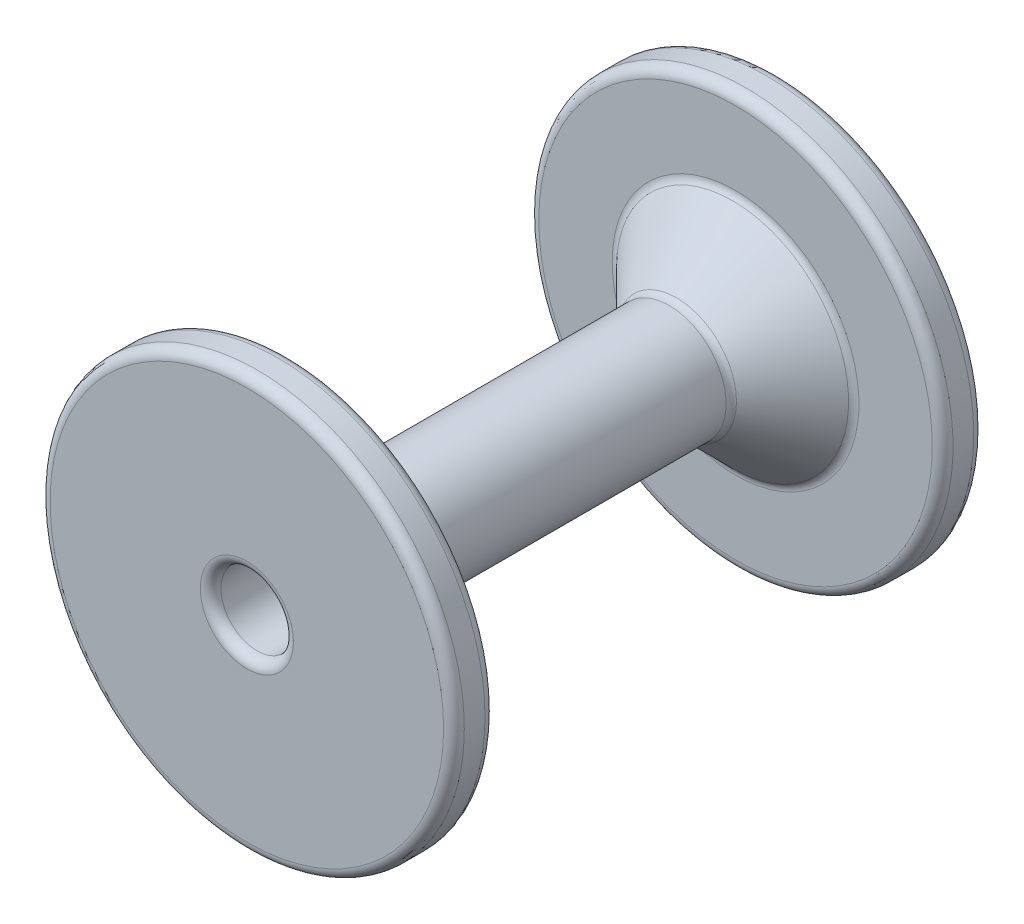
ISO-10303-21;
HEADER;
FILE_DESCRIPTION(('STEP AP214'),'2;1');
FILE_NAME('part.step','',(''),(''),'','','');
FILE_SCHEMA(('AUTOMOTIVE_DESIGN { 1 0 10303 214 1 1 1 1 }'));
ENDSEC;
DATA;
#1=APPLICATION_CONTEXT('core data for automotive mechanical design processes');
#2=APPLICATION_PROTOCOL_DEFINITION('international standard','automotive_design',2000,#1);
#3=PRODUCT_CONTEXT('',#1,'mechanical');
#4=PRODUCT('Part','Part','',(#3));
#5=PRODUCT_RELATED_PRODUCT_CATEGORY('part','',(#4));
#6=PRODUCT_DEFINITION_FORMATION('','',#4);
#7=PRODUCT_DEFINITION_CONTEXT('part definition',#1,'design');
#8=PRODUCT_DEFINITION('design','',#6,#7);
#9=PRODUCT_DEFINITION_SHAPE('','',#8);
#10=(LENGTH_UNIT() NAMED_UNIT(*) SI_UNIT(.MILLI.,.METRE.));
#11=(NAMED_UNIT(*) PLANE_ANGLE_UNIT() SI_UNIT($,.RADIAN.));
#12=(NAMED_UNIT(*) SI_UNIT($,.STERADIAN.) SOLID_ANGLE_UNIT());
#13=UNCERTAINTY_MEASURE_WITH_UNIT(LENGTH_MEASURE(1.E-05),#10,'distance_accuracy_value','');
#14=(GEOMETRIC_REPRESENTATION_CONTEXT(3) GLOBAL_UNCERTAINTY_ASSIGNED_CONTEXT((#13)) GLOBAL_UNIT_ASSIGNED_CONTEXT((#10,
#11,#12)) REPRESENTATION_CONTEXT('',''));
#15=CARTESIAN_POINT('',(0.,0.,0.));
#16=DIRECTION('',(0.,0.,1.));
#17=DIRECTION('',(1.,0.,0.));
#18=AXIS2_PLACEMENT_3D('',#15,#16,#17);
#19=CARTESIAN_POINT('',(0.,0.,12.8));
#20=DIRECTION('',(0.,0.,-1.));
#21=DIRECTION('',(-1.,0.,0.));
#22=AXIS2_PLACEMENT_3D('',#19,#20,#21);
#23=CYLINDRICAL_SURFACE('',#22,1.75);
#24=CARTESIAN_POINT('',(0.,0.,12.3));
#25=DIRECTION('',(0.,0.,1.));
#26=DIRECTION('',(1.,0.,0.));
#27=AXIS2_PLACEMENT_3D('',#24,#25,#26);
#28=CIRCLE('',#27,1.75);
#29=CARTESIAN_POINT('',(1.75,0.,12.3));
#30=VERTEX_POINT('',#29);
#31=EDGE_CURVE('E11',#30,#30,#28,.T.);
#32=ORIENTED_EDGE('',*,*,#31,.T.);
#33=EDGE_LOOP('',(#32));
#34=FACE_BOUND('',#33,.T.);
#35=CARTESIAN_POINT('',(0.,0.,-10.4));
#36=DIRECTION('',(0.,0.,-1.));
#37=DIRECTION('',(-1.,0.,0.));
#38=AXIS2_PLACEMENT_3D('',#35,#36,#37);
#39=CIRCLE('',#38,1.75);
#40=CARTESIAN_POINT('',(-1.75,0.,-10.4));
#41=VERTEX_POINT('',#40);
#42=EDGE_CURVE('E144',#41,#41,#39,.T.);
#43=ORIENTED_EDGE('',*,*,#42,.T.);
#44=EDGE_LOOP('',(#43));
#45=FACE_BOUND('',#44,.T.);
#46=ADVANCED_FACE('F36',(#34,#45),#23,.F.);
#47=CARTESIAN_POINT('',(0.,0.,12.8));
#48=DIRECTION('',(0.,0.,-1.));
#49=DIRECTION('',(-1.,0.,0.));
#50=AXIS2_PLACEMENT_3D('',#47,#48,#49);
#51=CYLINDRICAL_SURFACE('',#50,2.75);
#52=CARTESIAN_POINT('',(0.,0.,10.3));
#53=DIRECTION('',(0.,0.,1.));
#54=DIRECTION('',(1.,0.,0.));
#55=AXIS2_PLACEMENT_3D('',#52,#53,#54);
#56=CIRCLE('',#55,2.75);
#57=CARTESIAN_POINT('',(2.75,0.,10.3));
#58=VERTEX_POINT('',#57);
#59=EDGE_CURVE('E189',#58,#58,#56,.F.);
#60=ORIENTED_EDGE('',*,*,#59,.T.);
#61=EDGE_LOOP('',(#60));
#62=FACE_BOUND('',#61,.T.);
#63=CARTESIAN_POINT('',(0.,0.,-7.59289321881346));
#64=DIRECTION('',(0.,0.,1.));
#65=DIRECTION('',(1.,0.,0.));
#66=AXIS2_PLACEMENT_3D('',#63,#64,#65);
#67=CIRCLE('',#66,2.75);
#68=CARTESIAN_POINT('',(2.75,0.,-7.59289321881346));
#69=VERTEX_POINT('',#68);
#70=EDGE_CURVE('E186',#69,#69,#67,.T.);
#71=ORIENTED_EDGE('',*,*,#70,.T.);
#72=EDGE_LOOP('',(#71));
#73=FACE_BOUND('',#72,.T.);
#74=ADVANCED_FACE('F274',(#62,#73),#51,.T.);
#75=CARTESIAN_POINT('',(0.,0.,12.8));
#76=DIRECTION('',(0.,0.,1.));
#77=DIRECTION('',(1.,0.,0.));
#78=AXIS2_PLACEMENT_3D('',#75,#76,#77);
#79=PLANE('',#78);
#80=CARTESIAN_POINT('',(0.,0.,12.8));
#81=DIRECTION('',(0.,0.,1.));
#82=DIRECTION('',(1.,0.,0.));
#83=AXIS2_PLACEMENT_3D('',#80,#81,#82);
#84=CIRCLE('',#83,9.5);
#85=CARTESIAN_POINT('',(9.5,0.,12.8));
#86=VERTEX_POINT('',#85);
#87=EDGE_CURVE('E45',#86,#86,#84,.T.);
#88=ORIENTED_EDGE('',*,*,#87,.T.);
#89=EDGE_LOOP('',(#88));
#90=FACE_BOUND('',#89,.T.);
#91=CARTESIAN_POINT('',(0.,0.,12.8));
#92=DIRECTION('',(0.,0.,1.));
#93=DIRECTION('',(1.,0.,0.));
#94=AXIS2_PLACEMENT_3D('',#91,#92,#93);
#95=CIRCLE('',#94,2.25);
#96=CARTESIAN_POINT('',(2.25,0.,12.8));
#97=VERTEX_POINT('',#96);
#98=EDGE_CURVE('E219',#97,#97,#95,.F.);
#99=ORIENTED_EDGE('',*,*,#98,.T.);
#100=EDGE_LOOP('',(#99));
#101=FACE_BOUND('',#100,.T.);
#102=ADVANCED_FACE('F280',(#90,#101),#79,.T.);
#103=CARTESIAN_POINT('',(0.,0.,-12.8));
#104=DIRECTION('',(0.,0.,1.));
#105=DIRECTION('',(1.,0.,0.));
#106=AXIS2_PLACEMENT_3D('',#103,#104,#105);
#107=PLANE('',#106);
#108=CARTESIAN_POINT('',(0.,0.,-12.8));
#109=DIRECTION('',(0.,0.,1.));
#110=DIRECTION('',(1.,0.,0.));
#111=AXIS2_PLACEMENT_3D('',#108,#109,#110);
#112=CIRCLE('',#111,9.5);
#113=CARTESIAN_POINT('',(9.5,0.,-12.8));
#114=VERTEX_POINT('',#113);
#115=EDGE_CURVE('E205',#114,#114,#112,.F.);
#116=ORIENTED_EDGE('',*,*,#115,.T.);
#117=EDGE_LOOP('',(#116));
#118=FACE_BOUND('',#117,.T.);
#119=DIRECTION('',(-0.5,-0.866025403784439,0.));
#120=VECTOR('',#119,1.);
#121=CARTESIAN_POINT('',(2.81458256229942,-1.625,-12.8));
#122=LINE('',#121,#120);
#123=CARTESIAN_POINT('',(1.87638837486628,-3.25,-12.8));
#124=VERTEX_POINT('',#123);
#125=CARTESIAN_POINT('',(3.75277674973257,0.,-12.8));
#126=VERTEX_POINT('',#125);
#127=EDGE_CURVE('E200',#124,#126,#122,.F.);
#128=ORIENTED_EDGE('',*,*,#127,.T.);
#129=DIRECTION('',(0.5,-0.866025403784439,0.));
#130=VECTOR('',#129,1.);
#131=CARTESIAN_POINT('',(2.81458256229943,1.625,-12.8));
#132=LINE('',#131,#130);
#133=CARTESIAN_POINT('',(1.87638837486628,3.25,-12.8));
#134=VERTEX_POINT('',#133);
#135=EDGE_CURVE('E202',#126,#134,#132,.F.);
#136=ORIENTED_EDGE('',*,*,#135,.T.);
#137=DIRECTION('',(1.,0.,0.));
#138=VECTOR('',#137,1.);
#139=CARTESIAN_POINT('',(0.,3.25,-12.8));
#140=LINE('',#139,#138);
#141=CARTESIAN_POINT('',(-1.87638837486628,3.25,-12.8));
#142=VERTEX_POINT('',#141);
#143=EDGE_CURVE('E192',#134,#142,#140,.F.);
#144=ORIENTED_EDGE('',*,*,#143,.T.);
#145=DIRECTION('',(0.5,0.866025403784439,0.));
#146=VECTOR('',#145,1.);
#147=CARTESIAN_POINT('',(-2.81458256229943,1.625,-12.8));
#148=LINE('',#147,#146);
#149=CARTESIAN_POINT('',(-3.75277674973257,0.,-12.8));
#150=VERTEX_POINT('',#149);
#151=EDGE_CURVE('E194',#142,#150,#148,.F.);
#152=ORIENTED_EDGE('',*,*,#151,.T.);
#153=DIRECTION('',(-0.5,0.866025403784439,0.));
#154=VECTOR('',#153,1.);
#155=CARTESIAN_POINT('',(-2.81458256229942,-1.625,-12.8));
#156=LINE('',#155,#154);
#157=CARTESIAN_POINT('',(-1.87638837486628,-3.25,-12.8));
#158=VERTEX_POINT('',#157);
#159=EDGE_CURVE('E196',#150,#158,#156,.F.);
#160=ORIENTED_EDGE('',*,*,#159,.T.);
#161=DIRECTION('',(-1.,0.,0.));
#162=VECTOR('',#161,1.);
#163=CARTESIAN_POINT('',(0.,-3.25,-12.8));
#164=LINE('',#163,#162);
#165=EDGE_CURVE('E198',#158,#124,#164,.F.);
#166=ORIENTED_EDGE('',*,*,#165,.T.);
#167=EDGE_LOOP('',(#128,#136,#144,#152,#160,#166));
#168=FACE_BOUND('',#167,.T.);
#169=ADVANCED_FACE('F290',(#118,#168),#107,.F.);
#170=CARTESIAN_POINT('',(0.,0.,10.8));
#171=DIRECTION('',(0.,0.,1.));
#172=DIRECTION('',(1.,0.,0.));
#173=AXIS2_PLACEMENT_3D('',#170,#171,#172);
#174=CYLINDRICAL_SURFACE('',#173,10.);
#175=CARTESIAN_POINT('',(0.,0.,11.3));
#176=DIRECTION('',(0.,0.,1.));
#177=DIRECTION('',(1.,0.,0.));
#178=AXIS2_PLACEMENT_3D('',#175,#176,#177);
#179=CIRCLE('',#178,10.);
#180=CARTESIAN_POINT('',(10.,0.,11.3));
#181=VERTEX_POINT('',#180);
#182=EDGE_CURVE('E177',#181,#181,#179,.T.);
#183=ORIENTED_EDGE('',*,*,#182,.T.);
#184=EDGE_LOOP('',(#183));
#185=FACE_BOUND('',#184,.T.);
#186=CARTESIAN_POINT('',(0.,0.,12.3));
#187=DIRECTION('',(0.,0.,1.));
#188=DIRECTION('',(1.,0.,0.));
#189=AXIS2_PLACEMENT_3D('',#186,#187,#188);
#190=CIRCLE('',#189,10.);
#191=CARTESIAN_POINT('',(10.,0.,12.3));
#192=VERTEX_POINT('',#191);
#193=EDGE_CURVE('E174',#192,#192,#190,.F.);
#194=ORIENTED_EDGE('',*,*,#193,.T.);
#195=EDGE_LOOP('',(#194));
#196=FACE_BOUND('',#195,.T.);
#197=ADVANCED_FACE('F286',(#185,#196),#174,.T.);
#198=CARTESIAN_POINT('',(0.,0.,10.8));
#199=DIRECTION('',(0.,0.,1.));
#200=DIRECTION('',(1.,0.,0.));
#201=AXIS2_PLACEMENT_3D('',#198,#199,#200);
#202=PLANE('',#201);
#203=CARTESIAN_POINT('',(0.,0.,10.8));
#204=DIRECTION('',(0.,0.,1.));
#205=DIRECTION('',(1.,0.,0.));
#206=AXIS2_PLACEMENT_3D('',#203,#204,#205);
#207=CIRCLE('',#206,9.5);
#208=CARTESIAN_POINT('',(9.5,0.,10.8));
#209=VERTEX_POINT('',#208);
#210=EDGE_CURVE('E183',#209,#209,#207,.F.);
#211=ORIENTED_EDGE('',*,*,#210,.T.);
#212=EDGE_LOOP('',(#211));
#213=FACE_BOUND('',#212,.T.);
#214=CARTESIAN_POINT('',(0.,0.,10.8));
#215=DIRECTION('',(0.,0.,1.));
#216=DIRECTION('',(1.,0.,0.));
#217=AXIS2_PLACEMENT_3D('',#214,#215,#216);
#218=CIRCLE('',#217,3.25);
#219=CARTESIAN_POINT('',(3.25,0.,10.8));
#220=VERTEX_POINT('',#219);
#221=EDGE_CURVE('E180',#220,#220,#218,.T.);
#222=ORIENTED_EDGE('',*,*,#221,.T.);
#223=EDGE_LOOP('',(#222));
#224=FACE_BOUND('',#223,.T.);
#225=ADVANCED_FACE('F500',(#213,#224),#202,.F.);
#226=CARTESIAN_POINT('',(0.,0.,-10.8));
#227=DIRECTION('',(0.,0.,-1.));
#228=DIRECTION('',(1.,0.,0.));
#229=AXIS2_PLACEMENT_3D('',#226,#227,#228);
#230=PLANE('',#229);
#231=CARTESIAN_POINT('',(0.,0.,-10.8));
#232=DIRECTION('',(0.,0.,-1.));
#233=DIRECTION('',(-1.,0.,0.));
#234=AXIS2_PLACEMENT_3D('',#231,#232,#233);
#235=CIRCLE('',#234,9.5);
#236=CARTESIAN_POINT('',(-9.5,0.,-10.8));
#237=VERTEX_POINT('',#236);
#238=EDGE_CURVE('E159',#237,#237,#235,.F.);
#239=ORIENTED_EDGE('',*,*,#238,.T.);
#240=EDGE_LOOP('',(#239));
#241=FACE_BOUND('',#240,.T.);
#242=CARTESIAN_POINT('',(0.,0.,-10.8));
#243=DIRECTION('',(0.,0.,-1.));
#244=DIRECTION('',(-1.,0.,0.));
#245=AXIS2_PLACEMENT_3D('',#242,#243,#244);
#246=CIRCLE('',#245,5.95710678118656);
#247=CARTESIAN_POINT('',(-5.95710678118656,0.,-10.8));
#248=VERTEX_POINT('',#247);
#249=EDGE_CURVE('E156',#248,#248,#246,.T.);
#250=ORIENTED_EDGE('',*,*,#249,.T.);
#251=EDGE_LOOP('',(#250));
#252=FACE_BOUND('',#251,.T.);
#253=ADVANCED_FACE('F490',(#241,#252),#230,.F.);
#254=CARTESIAN_POINT('',(0.,0.,-10.8));
#255=DIRECTION('',(0.,0.,-1.));
#256=DIRECTION('',(-1.,0.,0.));
#257=AXIS2_PLACEMENT_3D('',#254,#255,#256);
#258=CYLINDRICAL_SURFACE('',#257,10.);
#259=CARTESIAN_POINT('',(0.,0.,-11.3));
#260=DIRECTION('',(0.,0.,-1.));
#261=DIRECTION('',(-1.,0.,0.));
#262=AXIS2_PLACEMENT_3D('',#259,#260,#261);
#263=CIRCLE('',#262,10.);
#264=CARTESIAN_POINT('',(-10.,0.,-11.3));
#265=VERTEX_POINT('',#264);
#266=EDGE_CURVE('E165',#265,#265,#263,.T.);
#267=ORIENTED_EDGE('',*,*,#266,.T.);
#268=EDGE_LOOP('',(#267));
#269=FACE_BOUND('',#268,.T.);
#270=CARTESIAN_POINT('',(0.,0.,-12.3));
#271=DIRECTION('',(0.,0.,1.));
#272=DIRECTION('',(1.,0.,0.));
#273=AXIS2_PLACEMENT_3D('',#270,#271,#272);
#274=CIRCLE('',#273,10.);
#275=CARTESIAN_POINT('',(10.,0.,-12.3));
#276=VERTEX_POINT('',#275);
#277=EDGE_CURVE('E162',#276,#276,#274,.T.);
#278=ORIENTED_EDGE('',*,*,#277,.T.);
#279=EDGE_LOOP('',(#278));
#280=FACE_BOUND('',#279,.T.);
#281=ADVANCED_FACE('F297',(#269,#280),#258,.T.);
#282=CARTESIAN_POINT('',(0.,0.,-10.8));
#283=DIRECTION('',(0.,0.,-1.));
#284=DIRECTION('',(-1.,0.,0.));
#285=AXIS2_PLACEMENT_3D('',#282,#283,#284);
#286=CONICAL_SURFACE('',#285,5.75000000000002,0.785398163397453);
#287=CARTESIAN_POINT('',(0.,0.,-10.6535533905933));
#288=DIRECTION('',(0.,0.,-1.));
#289=DIRECTION('',(-1.,0.,0.));
#290=AXIS2_PLACEMENT_3D('',#287,#288,#289);
#291=CIRCLE('',#290,5.60355339059329);
#292=CARTESIAN_POINT('',(-5.60355339059329,0.,-10.6535533905933));
#293=VERTEX_POINT('',#292);
#294=EDGE_CURVE('E171',#293,#293,#291,.F.);
#295=ORIENTED_EDGE('',*,*,#294,.T.);
#296=EDGE_LOOP('',(#295));
#297=FACE_BOUND('',#296,.T.);
#298=CARTESIAN_POINT('',(0.,0.,-7.94644660940674));
#299=DIRECTION('',(0.,0.,-1.));
#300=DIRECTION('',(-1.,0.,0.));
#301=AXIS2_PLACEMENT_3D('',#298,#299,#300);
#302=CIRCLE('',#301,2.89644660940673);
#303=CARTESIAN_POINT('',(-2.89644660940673,0.,-7.94644660940674));
#304=VERTEX_POINT('',#303);
#305=EDGE_CURVE('E168',#304,#304,#302,.T.);
#306=ORIENTED_EDGE('',*,*,#305,.T.);
#307=EDGE_LOOP('',(#306));
#308=FACE_BOUND('',#307,.T.);
#309=ADVANCED_FACE('F270',(#297,#308),#286,.T.);
#310=CARTESIAN_POINT('',(-3.17542648054294,0.,-10.4));
#311=DIRECTION('',(-0.866025403784439,0.5,0.));
#312=DIRECTION('',(-0.5,-0.866025403784439,0.));
#313=AXIS2_PLACEMENT_3D('',#310,#311,#312);
#314=PLANE('',#313);
#315=DIRECTION('',(0.,0.,-1.));
#316=VECTOR('',#315,1.);
#317=CARTESIAN_POINT('',(-3.17542648054294,0.,-10.4));
#318=LINE('',#317,#316);
#319=CARTESIAN_POINT('',(-3.17542648054294,0.,-10.4));
#320=VERTEX_POINT('',#319);
#321=CARTESIAN_POINT('',(-3.17542648054294,0.,-12.3));
#322=VERTEX_POINT('',#321);
#323=EDGE_CURVE('E142',#320,#322,#318,.T.);
#324=ORIENTED_EDGE('',*,*,#323,.T.);
#325=DIRECTION('',(0.5,0.866025403784439,0.));
#326=VECTOR('',#325,1.);
#327=CARTESIAN_POINT('',(-3.17542648054294,0.,-12.3));
#328=LINE('',#327,#326);
#329=CARTESIAN_POINT('',(-1.58771324027147,2.75,-12.3));
#330=VERTEX_POINT('',#329);
#331=EDGE_CURVE('E53',#322,#330,#328,.T.);
#332=ORIENTED_EDGE('',*,*,#331,.T.);
#333=DIRECTION('',(0.,0.,-1.));
#334=VECTOR('',#333,1.);
#335=CARTESIAN_POINT('',(-1.58771324027147,2.75,-10.4));
#336=LINE('',#335,#334);
#337=CARTESIAN_POINT('',(-1.58771324027147,2.75,-10.4));
#338=VERTEX_POINT('',#337);
#339=EDGE_CURVE('E108',#338,#330,#336,.T.);
#340=ORIENTED_EDGE('',*,*,#339,.F.);
#341=DIRECTION('',(0.5,0.866025403784439,0.));
#342=VECTOR('',#341,1.);
#343=CARTESIAN_POINT('',(-3.17542648054294,0.,-10.4));
#344=LINE('',#343,#342);
#345=EDGE_CURVE('E112',#320,#338,#344,.T.);
#346=ORIENTED_EDGE('',*,*,#345,.F.);
#347=EDGE_LOOP('',(#324,#332,#340,#346));
#348=FACE_BOUND('',#347,.T.);
#349=ADVANCED_FACE('F110',(#348),#314,.F.);
#350=CARTESIAN_POINT('',(-1.58771324027147,-2.75,-10.4));
#351=DIRECTION('',(-0.866025403784439,-0.5,0.));
#352=DIRECTION('',(0.5,-0.866025403784439,0.));
#353=AXIS2_PLACEMENT_3D('',#350,#351,#352);
#354=PLANE('',#353);
#355=DIRECTION('',(0.,0.,-1.));
#356=VECTOR('',#355,1.);
#357=CARTESIAN_POINT('',(-1.58771324027147,-2.75,-10.4));
#358=LINE('',#357,#356);
#359=CARTESIAN_POINT('',(-1.58771324027147,-2.75,-10.4));
#360=VERTEX_POINT('',#359);
#361=CARTESIAN_POINT('',(-1.58771324027147,-2.75,-12.3));
#362=VERTEX_POINT('',#361);
#363=EDGE_CURVE('E145',#360,#362,#358,.T.);
#364=ORIENTED_EDGE('',*,*,#363,.T.);
#365=DIRECTION('',(-0.5,0.866025403784439,0.));
#366=VECTOR('',#365,1.);
#367=CARTESIAN_POINT('',(-1.58771324027147,-2.75,-12.3));
#368=LINE('',#367,#366);
#369=EDGE_CURVE('E61',#362,#322,#368,.T.);
#370=ORIENTED_EDGE('',*,*,#369,.T.);
#371=ORIENTED_EDGE('',*,*,#323,.F.);
#372=DIRECTION('',(-0.5,0.866025403784439,0.));
#373=VECTOR('',#372,1.);
#374=CARTESIAN_POINT('',(-1.58771324027147,-2.75,-10.4));
#375=LINE('',#374,#373);
#376=EDGE_CURVE('E117',#360,#320,#375,.T.);
#377=ORIENTED_EDGE('',*,*,#376,.F.);
#378=EDGE_LOOP('',(#364,#370,#371,#377));
#379=FACE_BOUND('',#378,.T.);
#380=ADVANCED_FACE('F262',(#379),#354,.F.);
#381=CARTESIAN_POINT('',(1.58771324027147,-2.75,-10.4));
#382=DIRECTION('',(0.,-1.,0.));
#383=DIRECTION('',(1.,0.,0.));
#384=AXIS2_PLACEMENT_3D('',#381,#382,#383);
#385=PLANE('',#384);
#386=DIRECTION('',(0.,0.,-1.));
#387=VECTOR('',#386,1.);
#388=CARTESIAN_POINT('',(1.58771324027147,-2.75,-10.4));
#389=LINE('',#388,#387);
#390=CARTESIAN_POINT('',(1.58771324027147,-2.75,-10.4));
#391=VERTEX_POINT('',#390);
#392=CARTESIAN_POINT('',(1.58771324027147,-2.75,-12.3));
#393=VERTEX_POINT('',#392);
#394=EDGE_CURVE('E147',#391,#393,#389,.T.);
#395=ORIENTED_EDGE('',*,*,#394,.T.);
#396=DIRECTION('',(-1.,0.,0.));
#397=VECTOR('',#396,1.);
#398=CARTESIAN_POINT('',(1.58771324027147,-2.75,-12.3));
#399=LINE('',#398,#397);
#400=EDGE_CURVE('E213',#393,#362,#399,.T.);
#401=ORIENTED_EDGE('',*,*,#400,.T.);
#402=ORIENTED_EDGE('',*,*,#363,.F.);
#403=DIRECTION('',(-1.,0.,0.));
#404=VECTOR('',#403,1.);
#405=CARTESIAN_POINT('',(1.58771324027147,-2.75,-10.4));
#406=LINE('',#405,#404);
#407=EDGE_CURVE('E139',#391,#360,#406,.T.);
#408=ORIENTED_EDGE('',*,*,#407,.F.);
#409=EDGE_LOOP('',(#395,#401,#402,#408));
#410=FACE_BOUND('',#409,.T.);
#411=ADVANCED_FACE('F261',(#410),#385,.F.);
#412=CARTESIAN_POINT('',(3.17542648054294,0.,-10.4));
#413=DIRECTION('',(0.866025403784439,-0.5,0.));
#414=DIRECTION('',(0.5,0.866025403784439,0.));
#415=AXIS2_PLACEMENT_3D('',#412,#413,#414);
#416=PLANE('',#415);
#417=DIRECTION('',(0.,0.,-1.));
#418=VECTOR('',#417,1.);
#419=CARTESIAN_POINT('',(3.17542648054294,0.,-10.4));
#420=LINE('',#419,#418);
#421=CARTESIAN_POINT('',(3.17542648054294,0.,-10.4));
#422=VERTEX_POINT('',#421);
#423=CARTESIAN_POINT('',(3.17542648054294,0.,-12.3));
#424=VERTEX_POINT('',#423);
#425=EDGE_CURVE('E150',#422,#424,#420,.T.);
#426=ORIENTED_EDGE('',*,*,#425,.T.);
#427=DIRECTION('',(-0.5,-0.866025403784439,0.));
#428=VECTOR('',#427,1.);
#429=CARTESIAN_POINT('',(3.17542648054294,0.,-12.3));
#430=LINE('',#429,#428);
#431=EDGE_CURVE('E211',#424,#393,#430,.T.);
#432=ORIENTED_EDGE('',*,*,#431,.T.);
#433=ORIENTED_EDGE('',*,*,#394,.F.);
#434=DIRECTION('',(-0.5,-0.866025403784439,0.));
#435=VECTOR('',#434,1.);
#436=CARTESIAN_POINT('',(3.17542648054294,0.,-10.4));
#437=LINE('',#436,#435);
#438=EDGE_CURVE('E136',#422,#391,#437,.T.);
#439=ORIENTED_EDGE('',*,*,#438,.F.);
#440=EDGE_LOOP('',(#426,#432,#433,#439));
#441=FACE_BOUND('',#440,.T.);
#442=ADVANCED_FACE('F258',(#441),#416,.F.);
#443=CARTESIAN_POINT('',(1.58771324027147,2.75,-10.4));
#444=DIRECTION('',(0.866025403784439,0.5,0.));
#445=DIRECTION('',(-0.5,0.866025403784439,0.));
#446=AXIS2_PLACEMENT_3D('',#443,#444,#445);
#447=PLANE('',#446);
#448=DIRECTION('',(0.,0.,-1.));
#449=VECTOR('',#448,1.);
#450=CARTESIAN_POINT('',(1.58771324027147,2.75,-10.4));
#451=LINE('',#450,#449);
#452=CARTESIAN_POINT('',(1.58771324027147,2.75,-10.4));
#453=VERTEX_POINT('',#452);
#454=CARTESIAN_POINT('',(1.58771324027147,2.75,-12.3));
#455=VERTEX_POINT('',#454);
#456=EDGE_CURVE('E116',#453,#455,#451,.T.);
#457=ORIENTED_EDGE('',*,*,#456,.T.);
#458=DIRECTION('',(0.5,-0.866025403784439,0.));
#459=VECTOR('',#458,1.);
#460=CARTESIAN_POINT('',(1.58771324027147,2.75,-12.3));
#461=LINE('',#460,#459);
#462=EDGE_CURVE('E208',#455,#424,#461,.T.);
#463=ORIENTED_EDGE('',*,*,#462,.T.);
#464=ORIENTED_EDGE('',*,*,#425,.F.);
#465=DIRECTION('',(0.5,-0.866025403784439,0.));
#466=VECTOR('',#465,1.);
#467=CARTESIAN_POINT('',(1.58771324027147,2.75,-10.4));
#468=LINE('',#467,#466);
#469=EDGE_CURVE('E126',#453,#422,#468,.T.);
#470=ORIENTED_EDGE('',*,*,#469,.F.);
#471=EDGE_LOOP('',(#457,#463,#464,#470));
#472=FACE_BOUND('',#471,.T.);
#473=ADVANCED_FACE('F254',(#472),#447,.F.);
#474=CARTESIAN_POINT('',(-1.58771324027147,2.75,-10.4));
#475=DIRECTION('',(0.,1.,0.));
#476=DIRECTION('',(-1.,0.,0.));
#477=AXIS2_PLACEMENT_3D('',#474,#475,#476);
#478=PLANE('',#477);
#479=ORIENTED_EDGE('',*,*,#339,.T.);
#480=DIRECTION('',(1.,0.,0.));
#481=VECTOR('',#480,1.);
#482=CARTESIAN_POINT('',(-1.58771324027147,2.75,-12.3));
#483=LINE('',#482,#481);
#484=EDGE_CURVE('E217',#330,#455,#483,.T.);
#485=ORIENTED_EDGE('',*,*,#484,.T.);
#486=ORIENTED_EDGE('',*,*,#456,.F.);
#487=DIRECTION('',(1.,0.,0.));
#488=VECTOR('',#487,1.);
#489=CARTESIAN_POINT('',(-1.58771324027147,2.75,-10.4));
#490=LINE('',#489,#488);
#491=EDGE_CURVE('E120',#338,#453,#490,.T.);
#492=ORIENTED_EDGE('',*,*,#491,.F.);
#493=EDGE_LOOP('',(#479,#485,#486,#492));
#494=FACE_BOUND('',#493,.T.);
#495=ADVANCED_FACE('F121',(#494),#478,.F.);
#496=CARTESIAN_POINT('',(0.,0.,-10.4));
#497=DIRECTION('',(0.,0.,-1.));
#498=DIRECTION('',(-1.,0.,0.));
#499=AXIS2_PLACEMENT_3D('',#496,#497,#498);
#500=PLANE('',#499);
#501=ORIENTED_EDGE('',*,*,#42,.F.);
#502=EDGE_LOOP('',(#501));
#503=FACE_BOUND('',#502,.T.);
#504=ORIENTED_EDGE('',*,*,#345,.T.);
#505=ORIENTED_EDGE('',*,*,#491,.T.);
#506=ORIENTED_EDGE('',*,*,#469,.T.);
#507=ORIENTED_EDGE('',*,*,#438,.T.);
#508=ORIENTED_EDGE('',*,*,#407,.T.);
#509=ORIENTED_EDGE('',*,*,#376,.T.);
#510=EDGE_LOOP('',(#504,#505,#506,#507,#508,#509));
#511=FACE_BOUND('',#510,.T.);
#512=ADVANCED_FACE('F128',(#503,#511),#500,.T.);
#513=CARTESIAN_POINT('',(0.,0.,-11.3));
#514=DIRECTION('',(0.,0.,-1.));
#515=DIRECTION('',(-1.,0.,0.));
#516=AXIS2_PLACEMENT_3D('',#513,#514,#515);
#517=TOROIDAL_SURFACE('',#516,9.5,0.5);
#518=ORIENTED_EDGE('',*,*,#266,.F.);
#519=EDGE_LOOP('',(#518));
#520=FACE_BOUND('',#519,.T.);
#521=ORIENTED_EDGE('',*,*,#238,.F.);
#522=EDGE_LOOP('',(#521));
#523=FACE_BOUND('',#522,.T.);
#524=ADVANCED_FACE('F299',(#520,#523),#517,.T.);
#525=CARTESIAN_POINT('',(0.,0.,-10.3));
#526=DIRECTION('',(0.,0.,-1.));
#527=DIRECTION('',(-1.,0.,0.));
#528=AXIS2_PLACEMENT_3D('',#525,#526,#527);
#529=TOROIDAL_SURFACE('',#528,5.95710678118656,0.5);
#530=ORIENTED_EDGE('',*,*,#294,.F.);
#531=EDGE_LOOP('',(#530));
#532=FACE_BOUND('',#531,.T.);
#533=ORIENTED_EDGE('',*,*,#249,.F.);
#534=EDGE_LOOP('',(#533));
#535=FACE_BOUND('',#534,.T.);
#536=ADVANCED_FACE('F302',(#532,#535),#529,.F.);
#537=CARTESIAN_POINT('',(0.,0.,11.3));
#538=DIRECTION('',(0.,0.,1.));
#539=DIRECTION('',(1.,0.,0.));
#540=AXIS2_PLACEMENT_3D('',#537,#538,#539);
#541=TOROIDAL_SURFACE('',#540,9.5,0.5);
#542=ORIENTED_EDGE('',*,*,#210,.F.);
#543=EDGE_LOOP('',(#542));
#544=FACE_BOUND('',#543,.T.);
#545=ORIENTED_EDGE('',*,*,#182,.F.);
#546=EDGE_LOOP('',(#545));
#547=FACE_BOUND('',#546,.T.);
#548=ADVANCED_FACE('F306',(#544,#547),#541,.T.);
#549=CARTESIAN_POINT('',(0.,0.,10.3));
#550=DIRECTION('',(0.,0.,1.));
#551=DIRECTION('',(1.,0.,0.));
#552=AXIS2_PLACEMENT_3D('',#549,#550,#551);
#553=TOROIDAL_SURFACE('',#552,3.25,0.5);
#554=ORIENTED_EDGE('',*,*,#59,.F.);
#555=EDGE_LOOP('',(#554));
#556=FACE_BOUND('',#555,.T.);
#557=ORIENTED_EDGE('',*,*,#221,.F.);
#558=EDGE_LOOP('',(#557));
#559=FACE_BOUND('',#558,.T.);
#560=ADVANCED_FACE('F310',(#556,#559),#553,.F.);
#561=CARTESIAN_POINT('',(0.,0.,-12.3));
#562=DIRECTION('',(0.,0.,1.));
#563=DIRECTION('',(1.,0.,0.));
#564=AXIS2_PLACEMENT_3D('',#561,#562,#563);
#565=TOROIDAL_SURFACE('',#564,9.5,0.5);
#566=ORIENTED_EDGE('',*,*,#115,.F.);
#567=EDGE_LOOP('',(#566));
#568=FACE_BOUND('',#567,.T.);
#569=ORIENTED_EDGE('',*,*,#277,.F.);
#570=EDGE_LOOP('',(#569));
#571=FACE_BOUND('',#570,.T.);
#572=ADVANCED_FACE('F314',(#568,#571),#565,.T.);
#573=CARTESIAN_POINT('',(-2.02072594216369,-3.,-12.3));
#574=DIRECTION('',(-0.5,0.866025403784439,0.));
#575=DIRECTION('',(-0.866025403784439,-0.5,0.));
#576=AXIS2_PLACEMENT_3D('',#573,#574,#575);
#577=CYLINDRICAL_SURFACE('',#576,0.5);
#578=CARTESIAN_POINT('',(-1.87638837486628,-3.25,-12.3));
#579=DIRECTION('',(-0.866025403784439,0.5,0.));
#580=DIRECTION('',(-0.5,-0.866025403784439,0.));
#581=AXIS2_PLACEMENT_3D('',#578,#579,#580);
#582=ELLIPSE('',#581,0.577350269189626,0.5);
#583=EDGE_CURVE('E133',#158,#362,#582,.F.);
#584=ORIENTED_EDGE('',*,*,#583,.F.);
#585=ORIENTED_EDGE('',*,*,#159,.F.);
#586=CARTESIAN_POINT('',(-3.75277674973257,0.,-12.3));
#587=DIRECTION('',(0.,1.,0.));
#588=DIRECTION('',(-1.,0.,0.));
#589=AXIS2_PLACEMENT_3D('',#586,#587,#588);
#590=ELLIPSE('',#589,0.577350269189626,0.5);
#591=EDGE_CURVE('E40',#322,#150,#590,.T.);
#592=ORIENTED_EDGE('',*,*,#591,.F.);
#593=ORIENTED_EDGE('',*,*,#369,.F.);
#594=EDGE_LOOP('',(#584,#585,#592,#593));
#595=FACE_BOUND('',#594,.T.);
#596=ADVANCED_FACE('F242',(#595),#577,.T.);
#597=CARTESIAN_POINT('',(-3.60843918243516,0.250000000000004,-12.3));
#598=DIRECTION('',(0.5,0.866025403784439,0.));
#599=DIRECTION('',(-0.866025403784439,0.5,0.));
#600=AXIS2_PLACEMENT_3D('',#597,#598,#599);
#601=CYLINDRICAL_SURFACE('',#600,0.5);
#602=ORIENTED_EDGE('',*,*,#591,.T.);
#603=ORIENTED_EDGE('',*,*,#151,.F.);
#604=CARTESIAN_POINT('',(-1.87638837486628,3.25,-12.3));
#605=DIRECTION('',(0.866025403784439,0.5,0.));
#606=DIRECTION('',(-0.5,0.866025403784439,0.));
#607=AXIS2_PLACEMENT_3D('',#604,#605,#606);
#608=ELLIPSE('',#607,0.577350269189626,0.5);
#609=EDGE_CURVE('E231',#330,#142,#608,.T.);
#610=ORIENTED_EDGE('',*,*,#609,.F.);
#611=ORIENTED_EDGE('',*,*,#331,.F.);
#612=EDGE_LOOP('',(#602,#603,#610,#611));
#613=FACE_BOUND('',#612,.T.);
#614=ADVANCED_FACE('F246',(#613),#601,.T.);
#615=CARTESIAN_POINT('',(1.58771324027147,-3.25,-12.3));
#616=DIRECTION('',(-1.,0.,0.));
#617=DIRECTION('',(0.,-1.,0.));
#618=AXIS2_PLACEMENT_3D('',#615,#616,#617);
#619=CYLINDRICAL_SURFACE('',#618,0.5);
#620=ORIENTED_EDGE('',*,*,#583,.T.);
#621=ORIENTED_EDGE('',*,*,#400,.F.);
#622=CARTESIAN_POINT('',(1.87638837486628,-3.25,-12.3));
#623=DIRECTION('',(-0.866025403784439,-0.5,0.));
#624=DIRECTION('',(0.5,-0.866025403784439,0.));
#625=AXIS2_PLACEMENT_3D('',#622,#623,#624);
#626=ELLIPSE('',#625,0.577350269189626,0.5);
#627=EDGE_CURVE('E228',#124,#393,#626,.F.);
#628=ORIENTED_EDGE('',*,*,#627,.F.);
#629=ORIENTED_EDGE('',*,*,#165,.F.);
#630=EDGE_LOOP('',(#620,#621,#628,#629));
#631=FACE_BOUND('',#630,.T.);
#632=ADVANCED_FACE('F238',(#631),#619,.T.);
#633=CARTESIAN_POINT('',(-1.58771324027147,3.25,-12.3));
#634=DIRECTION('',(1.,0.,0.));
#635=DIRECTION('',(0.,1.,0.));
#636=AXIS2_PLACEMENT_3D('',#633,#634,#635);
#637=CYLINDRICAL_SURFACE('',#636,0.5);
#638=ORIENTED_EDGE('',*,*,#609,.T.);
#639=ORIENTED_EDGE('',*,*,#143,.F.);
#640=CARTESIAN_POINT('',(1.87638837486628,3.25,-12.3));
#641=DIRECTION('',(0.866025403784439,-0.5,0.));
#642=DIRECTION('',(-0.5,-0.866025403784439,0.));
#643=AXIS2_PLACEMENT_3D('',#640,#641,#642);
#644=ELLIPSE('',#643,0.577350269189626,0.5);
#645=EDGE_CURVE('E226',#455,#134,#644,.T.);
#646=ORIENTED_EDGE('',*,*,#645,.F.);
#647=ORIENTED_EDGE('',*,*,#484,.F.);
#648=EDGE_LOOP('',(#638,#639,#646,#647));
#649=FACE_BOUND('',#648,.T.);
#650=ADVANCED_FACE('F251',(#649),#637,.T.);
#651=CARTESIAN_POINT('',(3.60843918243516,-0.249999999999998,-12.3));
#652=DIRECTION('',(-0.5,-0.866025403784439,0.));
#653=DIRECTION('',(0.866025403784439,-0.5,0.));
#654=AXIS2_PLACEMENT_3D('',#651,#652,#653);
#655=CYLINDRICAL_SURFACE('',#654,0.5);
#656=ORIENTED_EDGE('',*,*,#627,.T.);
#657=ORIENTED_EDGE('',*,*,#431,.F.);
#658=CARTESIAN_POINT('',(3.75277674973257,0.,-12.3));
#659=DIRECTION('',(0.,-1.,0.));
#660=DIRECTION('',(1.,0.,0.));
#661=AXIS2_PLACEMENT_3D('',#658,#659,#660);
#662=ELLIPSE('',#661,0.577350269189626,0.5);
#663=EDGE_CURVE('E224',#126,#424,#662,.F.);
#664=ORIENTED_EDGE('',*,*,#663,.F.);
#665=ORIENTED_EDGE('',*,*,#127,.F.);
#666=EDGE_LOOP('',(#656,#657,#664,#665));
#667=FACE_BOUND('',#666,.T.);
#668=ADVANCED_FACE('F323',(#667),#655,.T.);
#669=CARTESIAN_POINT('',(2.02072594216369,3.,-12.3));
#670=DIRECTION('',(0.5,-0.866025403784439,0.));
#671=DIRECTION('',(0.866025403784439,0.5,0.));
#672=AXIS2_PLACEMENT_3D('',#669,#670,#671);
#673=CYLINDRICAL_SURFACE('',#672,0.5);
#674=ORIENTED_EDGE('',*,*,#645,.T.);
#675=ORIENTED_EDGE('',*,*,#135,.F.);
#676=ORIENTED_EDGE('',*,*,#663,.T.);
#677=ORIENTED_EDGE('',*,*,#462,.F.);
#678=EDGE_LOOP('',(#674,#675,#676,#677));
#679=FACE_BOUND('',#678,.T.);
#680=ADVANCED_FACE('F319',(#679),#673,.T.);
#681=CARTESIAN_POINT('',(0.,0.,12.3));
#682=DIRECTION('',(0.,0.,1.));
#683=DIRECTION('',(1.,0.,0.));
#684=AXIS2_PLACEMENT_3D('',#681,#682,#683);
#685=TOROIDAL_SURFACE('',#684,9.5,0.5);
#686=ORIENTED_EDGE('',*,*,#193,.F.);
#687=EDGE_LOOP('',(#686));
#688=FACE_BOUND('',#687,.T.);
#689=ORIENTED_EDGE('',*,*,#87,.F.);
#690=EDGE_LOOP('',(#689));
#691=FACE_BOUND('',#690,.T.);
#692=ADVANCED_FACE('F322',(#688,#691),#685,.T.);
#693=CARTESIAN_POINT('',(0.,0.,12.3));
#694=DIRECTION('',(0.,0.,1.));
#695=DIRECTION('',(1.,0.,0.));
#696=AXIS2_PLACEMENT_3D('',#693,#694,#695);
#697=TOROIDAL_SURFACE('',#696,2.25,0.5);
#698=ORIENTED_EDGE('',*,*,#98,.F.);
#699=EDGE_LOOP('',(#698));
#700=FACE_BOUND('',#699,.T.);
#701=ORIENTED_EDGE('',*,*,#31,.F.);
#702=EDGE_LOOP('',(#701));
#703=FACE_BOUND('',#702,.T.);
#704=ADVANCED_FACE('F337',(#700,#703),#697,.T.);
#705=CARTESIAN_POINT('',(0.,0.,-7.59289321881346));
#706=DIRECTION('',(0.,0.,1.));
#707=DIRECTION('',(1.,0.,0.));
#708=AXIS2_PLACEMENT_3D('',#705,#706,#707);
#709=TOROIDAL_SURFACE('',#708,3.25,0.5);
#710=ORIENTED_EDGE('',*,*,#305,.F.);
#711=EDGE_LOOP('',(#710));
#712=FACE_BOUND('',#711,.T.);
#713=ORIENTED_EDGE('',*,*,#70,.F.);
#714=EDGE_LOOP('',(#713));
#715=FACE_BOUND('',#714,.T.);
#716=ADVANCED_FACE('F38',(#712,#715),#709,.F.);
#717=CLOSED_SHELL('',(#46,#74,#102,#169,#197,#225,#253,#281,#309,#349,#380,#411,#442,#473,#495,
#512,#524,#536,#548,#560,#572,#596,#614,#632,#650,#668,#680,#692,#704,#716));
#718=MANIFOLD_SOLID_BREP('B2',#717);
#719=ADVANCED_BREP_SHAPE_REPRESENTATION('',(#18,#718),#14);
#720=SHAPE_DEFINITION_REPRESENTATION(#9,#719);
ENDSEC;
END-ISO-10303-21;
